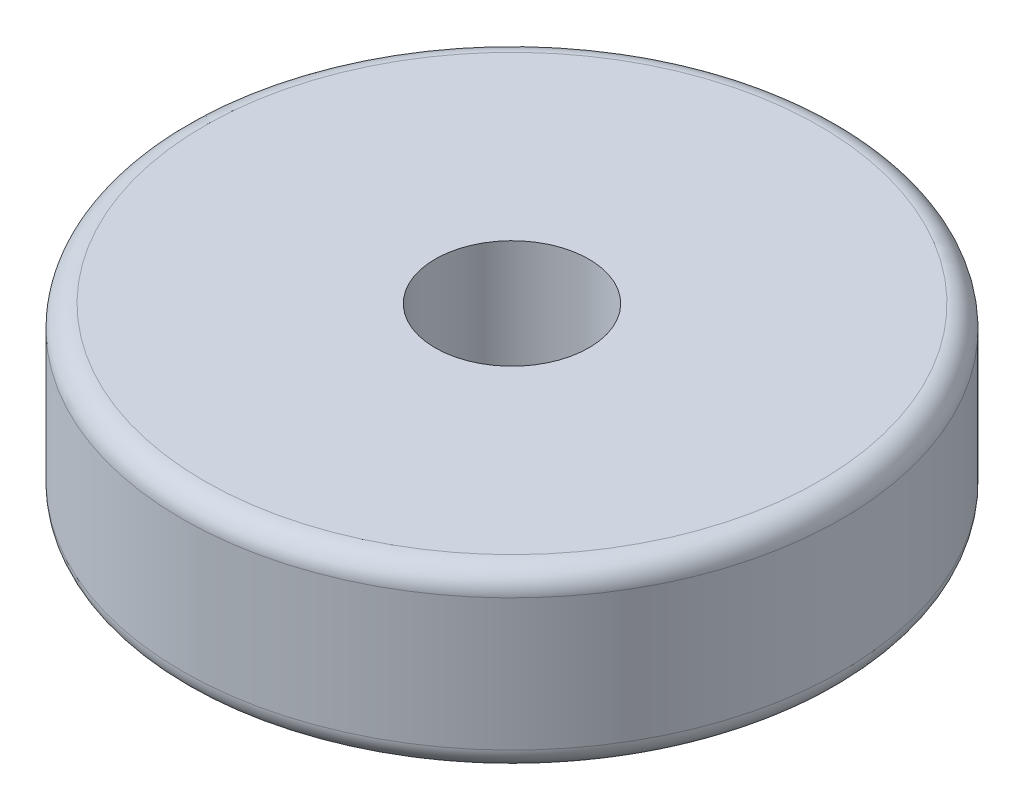
ISO-10303-21;
HEADER;
FILE_DESCRIPTION(('STEP AP214'),'2;1');
FILE_NAME('part.step','',(''),(''),'','','');
FILE_SCHEMA(('AUTOMOTIVE_DESIGN { 1 0 10303 214 1 1 1 1 }'));
ENDSEC;
DATA;
#1=APPLICATION_CONTEXT('core data for automotive mechanical design processes');
#2=APPLICATION_PROTOCOL_DEFINITION('international standard','automotive_design',2000,#1);
#3=PRODUCT_CONTEXT('',#1,'mechanical');
#4=PRODUCT('Part','Part','',(#3));
#5=PRODUCT_RELATED_PRODUCT_CATEGORY('part','',(#4));
#6=PRODUCT_DEFINITION_FORMATION('','',#4);
#7=PRODUCT_DEFINITION_CONTEXT('part definition',#1,'design');
#8=PRODUCT_DEFINITION('design','',#6,#7);
#9=PRODUCT_DEFINITION_SHAPE('','',#8);
#10=(LENGTH_UNIT() NAMED_UNIT(*) SI_UNIT(.MILLI.,.METRE.));
#11=(NAMED_UNIT(*) PLANE_ANGLE_UNIT() SI_UNIT($,.RADIAN.));
#12=(NAMED_UNIT(*) SI_UNIT($,.STERADIAN.) SOLID_ANGLE_UNIT());
#13=UNCERTAINTY_MEASURE_WITH_UNIT(LENGTH_MEASURE(1.E-05),#10,'distance_accuracy_value','');
#14=(GEOMETRIC_REPRESENTATION_CONTEXT(3) GLOBAL_UNCERTAINTY_ASSIGNED_CONTEXT((#13)) GLOBAL_UNIT_ASSIGNED_CONTEXT((#10,
#11,#12)) REPRESENTATION_CONTEXT('',''));
#15=CARTESIAN_POINT('',(0.,0.,0.));
#16=DIRECTION('',(0.,0.,1.));
#17=DIRECTION('',(1.,0.,0.));
#18=AXIS2_PLACEMENT_3D('',#15,#16,#17);
#19=CARTESIAN_POINT('',(0.,4.,0.));
#20=DIRECTION('',(0.,-1.,0.));
#21=DIRECTION('',(0.,0.,-1.));
#22=AXIS2_PLACEMENT_3D('',#19,#20,#21);
#23=CYLINDRICAL_SURFACE('',#22,7.5);
#24=CARTESIAN_POINT('',(0.,0.5,0.));
#25=DIRECTION('',(0.,1.,0.));
#26=DIRECTION('',(0.,0.,1.));
#27=AXIS2_PLACEMENT_3D('',#24,#25,#26);
#28=CIRCLE('',#27,7.5);
#29=CARTESIAN_POINT('',(0.,0.5,7.5));
#30=VERTEX_POINT('',#29);
#31=EDGE_CURVE('E50',#30,#30,#28,.T.);
#32=ORIENTED_EDGE('',*,*,#31,.T.);
#33=EDGE_LOOP('',(#32));
#34=FACE_BOUND('',#33,.T.);
#35=CARTESIAN_POINT('',(0.,3.5,0.));
#36=DIRECTION('',(0.,1.,0.));
#37=DIRECTION('',(0.,0.,1.));
#38=AXIS2_PLACEMENT_3D('',#35,#36,#37);
#39=CIRCLE('',#38,7.5);
#40=CARTESIAN_POINT('',(0.,3.5,7.5));
#41=VERTEX_POINT('',#40);
#42=EDGE_CURVE('E54',#41,#41,#39,.F.);
#43=ORIENTED_EDGE('',*,*,#42,.T.);
#44=EDGE_LOOP('',(#43));
#45=FACE_BOUND('',#44,.T.);
#46=ADVANCED_FACE('F39',(#34,#45),#23,.T.);
#47=CARTESIAN_POINT('',(0.,4.,0.));
#48=DIRECTION('',(0.,1.,0.));
#49=DIRECTION('',(0.,0.,1.));
#50=AXIS2_PLACEMENT_3D('',#47,#48,#49);
#51=PLANE('',#50);
#52=CARTESIAN_POINT('',(0.,4.,0.));
#53=DIRECTION('',(0.,1.,0.));
#54=DIRECTION('',(0.,0.,1.));
#55=AXIS2_PLACEMENT_3D('',#52,#53,#54);
#56=CIRCLE('',#55,7.);
#57=CARTESIAN_POINT('',(0.,4.,7.));
#58=VERTEX_POINT('',#57);
#59=EDGE_CURVE('E10',#58,#58,#56,.T.);
#60=ORIENTED_EDGE('',*,*,#59,.T.);
#61=EDGE_LOOP('',(#60));
#62=FACE_BOUND('',#61,.T.);
#63=CARTESIAN_POINT('',(0.,4.,0.));
#64=DIRECTION('',(0.,1.,0.));
#65=DIRECTION('',(0.,0.,1.));
#66=AXIS2_PLACEMENT_3D('',#63,#64,#65);
#67=CIRCLE('',#66,1.75);
#68=CARTESIAN_POINT('',(0.,4.,1.75));
#69=VERTEX_POINT('',#68);
#70=EDGE_CURVE('E60',#69,#69,#67,.T.);
#71=ORIENTED_EDGE('',*,*,#70,.F.);
#72=EDGE_LOOP('',(#71));
#73=FACE_BOUND('',#72,.T.);
#74=ADVANCED_FACE('F75',(#62,#73),#51,.T.);
#75=CARTESIAN_POINT('',(0.,0.,0.));
#76=DIRECTION('',(0.,1.,0.));
#77=DIRECTION('',(0.,0.,1.));
#78=AXIS2_PLACEMENT_3D('',#75,#76,#77);
#79=PLANE('',#78);
#80=CARTESIAN_POINT('',(0.,0.,0.));
#81=DIRECTION('',(0.,1.,0.));
#82=DIRECTION('',(0.,0.,1.));
#83=AXIS2_PLACEMENT_3D('',#80,#81,#82);
#84=CIRCLE('',#83,7.);
#85=CARTESIAN_POINT('',(0.,0.,7.));
#86=VERTEX_POINT('',#85);
#87=EDGE_CURVE('E46',#86,#86,#84,.F.);
#88=ORIENTED_EDGE('',*,*,#87,.T.);
#89=EDGE_LOOP('',(#88));
#90=FACE_BOUND('',#89,.T.);
#91=CARTESIAN_POINT('',(0.,0.,0.));
#92=DIRECTION('',(0.,1.,0.));
#93=DIRECTION('',(0.,0.,1.));
#94=AXIS2_PLACEMENT_3D('',#91,#92,#93);
#95=CIRCLE('',#94,1.75);
#96=CARTESIAN_POINT('',(0.,0.,1.75));
#97=VERTEX_POINT('',#96);
#98=EDGE_CURVE('E59',#97,#97,#95,.T.);
#99=ORIENTED_EDGE('',*,*,#98,.T.);
#100=EDGE_LOOP('',(#99));
#101=FACE_BOUND('',#100,.T.);
#102=ADVANCED_FACE('F66',(#90,#101),#79,.F.);
#103=CARTESIAN_POINT('',(0.,0.,0.));
#104=DIRECTION('',(0.,1.,0.));
#105=DIRECTION('',(0.,0.,1.));
#106=AXIS2_PLACEMENT_3D('',#103,#104,#105);
#107=CYLINDRICAL_SURFACE('',#106,1.75);
#108=ORIENTED_EDGE('',*,*,#98,.F.);
#109=EDGE_LOOP('',(#108));
#110=FACE_BOUND('',#109,.T.);
#111=ORIENTED_EDGE('',*,*,#70,.T.);
#112=EDGE_LOOP('',(#111));
#113=FACE_BOUND('',#112,.T.);
#114=ADVANCED_FACE('F68',(#110,#113),#107,.F.);
#115=CARTESIAN_POINT('',(0.,0.5,0.));
#116=DIRECTION('',(0.,1.,0.));
#117=DIRECTION('',(0.,0.,1.));
#118=AXIS2_PLACEMENT_3D('',#115,#116,#117);
#119=TOROIDAL_SURFACE('',#118,7.,0.5);
#120=ORIENTED_EDGE('',*,*,#87,.F.);
#121=EDGE_LOOP('',(#120));
#122=FACE_BOUND('',#121,.T.);
#123=ORIENTED_EDGE('',*,*,#31,.F.);
#124=EDGE_LOOP('',(#123));
#125=FACE_BOUND('',#124,.T.);
#126=ADVANCED_FACE('F71',(#122,#125),#119,.T.);
#127=CARTESIAN_POINT('',(0.,3.5,0.));
#128=DIRECTION('',(0.,1.,0.));
#129=DIRECTION('',(0.,0.,1.));
#130=AXIS2_PLACEMENT_3D('',#127,#128,#129);
#131=TOROIDAL_SURFACE('',#130,7.,0.5);
#132=ORIENTED_EDGE('',*,*,#42,.F.);
#133=EDGE_LOOP('',(#132));
#134=FACE_BOUND('',#133,.T.);
#135=ORIENTED_EDGE('',*,*,#59,.F.);
#136=EDGE_LOOP('',(#135));
#137=FACE_BOUND('',#136,.T.);
#138=ADVANCED_FACE('F41',(#134,#137),#131,.T.);
#139=CLOSED_SHELL('',(#46,#74,#102,#114,#126,#138));
#140=MANIFOLD_SOLID_BREP('B2',#139);
#141=ADVANCED_BREP_SHAPE_REPRESENTATION('',(#18,#140),#14);
#142=SHAPE_DEFINITION_REPRESENTATION(#9,#141);
ENDSEC;
END-ISO-10303-21;
